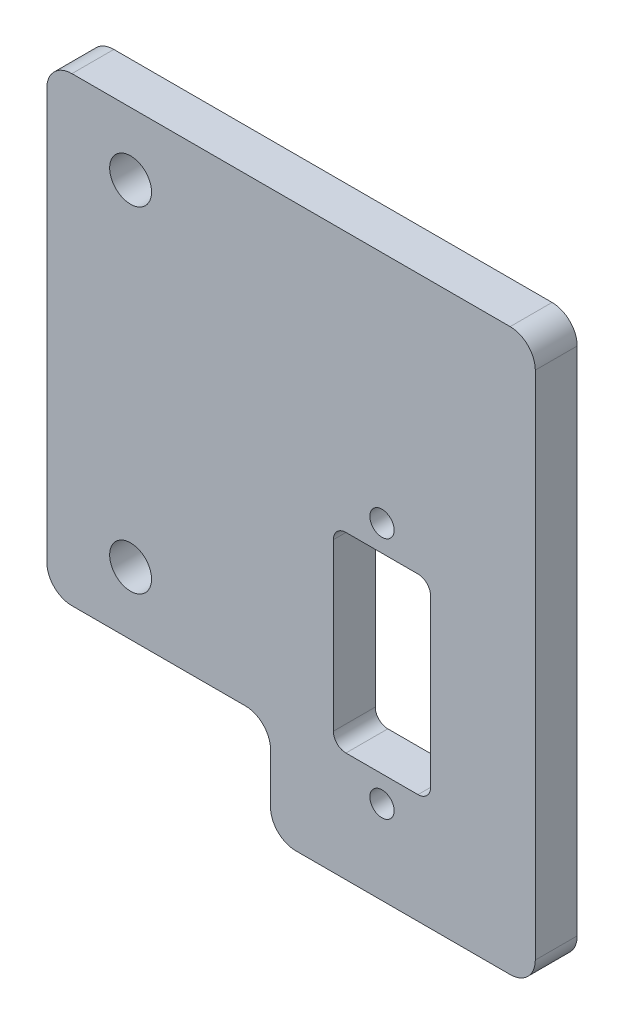
ISO-10303-21;
HEADER;
FILE_DESCRIPTION(('STEP AP214'),'2;1');
FILE_NAME('part.step','',(''),(''),'','','');
FILE_SCHEMA(('AUTOMOTIVE_DESIGN { 1 0 10303 214 1 1 1 1 }'));
ENDSEC;
DATA;
#1=APPLICATION_CONTEXT('core data for automotive mechanical design processes');
#2=APPLICATION_PROTOCOL_DEFINITION('international standard','automotive_design',2000,#1);
#3=PRODUCT_CONTEXT('',#1,'mechanical');
#4=PRODUCT('Part','Part','',(#3));
#5=PRODUCT_RELATED_PRODUCT_CATEGORY('part','',(#4));
#6=PRODUCT_DEFINITION_FORMATION('','',#4);
#7=PRODUCT_DEFINITION_CONTEXT('part definition',#1,'design');
#8=PRODUCT_DEFINITION('design','',#6,#7);
#9=PRODUCT_DEFINITION_SHAPE('','',#8);
#10=(LENGTH_UNIT() NAMED_UNIT(*) SI_UNIT(.MILLI.,.METRE.));
#11=(NAMED_UNIT(*) PLANE_ANGLE_UNIT() SI_UNIT($,.RADIAN.));
#12=(NAMED_UNIT(*) SI_UNIT($,.STERADIAN.) SOLID_ANGLE_UNIT());
#13=UNCERTAINTY_MEASURE_WITH_UNIT(LENGTH_MEASURE(1.E-05),#10,'distance_accuracy_value','');
#14=(GEOMETRIC_REPRESENTATION_CONTEXT(3) GLOBAL_UNCERTAINTY_ASSIGNED_CONTEXT((#13)) GLOBAL_UNIT_ASSIGNED_CONTEXT((#10,
#11,#12)) REPRESENTATION_CONTEXT('',''));
#15=CARTESIAN_POINT('',(0.,0.,0.));
#16=DIRECTION('',(0.,0.,1.));
#17=DIRECTION('',(1.,0.,0.));
#18=AXIS2_PLACEMENT_3D('',#15,#16,#17);
#19=CARTESIAN_POINT('',(0.,0.,5.));
#20=DIRECTION('',(0.,0.,-1.));
#21=DIRECTION('',(-1.,0.,0.));
#22=AXIS2_PLACEMENT_3D('',#19,#20,#21);
#23=PLANE('',#22);
#24=CARTESIAN_POINT('',(13.3,-0.469999999999991,5.));
#25=DIRECTION('',(0.,0.,1.));
#26=DIRECTION('',(1.,0.,0.));
#27=AXIS2_PLACEMENT_3D('',#24,#25,#26);
#28=CIRCLE('',#27,1.45);
#29=CARTESIAN_POINT('',(14.75,-0.469999999999991,5.));
#30=VERTEX_POINT('',#29);
#31=EDGE_CURVE('E408',#30,#30,#28,.T.);
#32=ORIENTED_EDGE('',*,*,#31,.F.);
#33=EDGE_LOOP('',(#32));
#34=FACE_BOUND('',#33,.T.);
#35=CARTESIAN_POINT('',(13.3,-29.47,5.));
#36=DIRECTION('',(0.,0.,1.));
#37=DIRECTION('',(1.,0.,0.));
#38=AXIS2_PLACEMENT_3D('',#35,#36,#37);
#39=CIRCLE('',#38,1.45);
#40=CARTESIAN_POINT('',(14.75,-29.47,5.));
#41=VERTEX_POINT('',#40);
#42=EDGE_CURVE('E410',#41,#41,#39,.T.);
#43=ORIENTED_EDGE('',*,*,#42,.F.);
#44=EDGE_LOOP('',(#43));
#45=FACE_BOUND('',#44,.T.);
#46=CARTESIAN_POINT('',(-16.7,-20.,5.));
#47=DIRECTION('',(0.,0.,-1.));
#48=DIRECTION('',(-1.,0.,0.));
#49=AXIS2_PLACEMENT_3D('',#46,#47,#48);
#50=CIRCLE('',#49,2.5);
#51=CARTESIAN_POINT('',(-19.2,-20.,5.));
#52=VERTEX_POINT('',#51);
#53=EDGE_CURVE('E421',#52,#52,#50,.T.);
#54=ORIENTED_EDGE('',*,*,#53,.T.);
#55=EDGE_LOOP('',(#54));
#56=FACE_BOUND('',#55,.T.);
#57=CARTESIAN_POINT('',(-16.7,20.,5.));
#58=DIRECTION('',(0.,0.,-1.));
#59=DIRECTION('',(-1.,0.,0.));
#60=AXIS2_PLACEMENT_3D('',#57,#58,#59);
#61=CIRCLE('',#60,2.5);
#62=CARTESIAN_POINT('',(-19.2,20.,5.));
#63=VERTEX_POINT('',#62);
#64=EDGE_CURVE('E312',#63,#63,#61,.T.);
#65=ORIENTED_EDGE('',*,*,#64,.T.);
#66=EDGE_LOOP('',(#65));
#67=FACE_BOUND('',#66,.T.);
#68=DIRECTION('',(0.,1.,0.));
#69=VECTOR('',#68,1.);
#70=CARTESIAN_POINT('',(31.6,27.5,5.));
#71=LINE('',#70,#69);
#72=CARTESIAN_POINT('',(31.6,-36.47,5.));
#73=VERTEX_POINT('',#72);
#74=CARTESIAN_POINT('',(31.6,24.5,5.));
#75=VERTEX_POINT('',#74);
#76=EDGE_CURVE('E205',#73,#75,#71,.T.);
#77=ORIENTED_EDGE('',*,*,#76,.T.);
#78=CARTESIAN_POINT('',(28.6,24.5,5.));
#79=DIRECTION('',(0.,0.,-1.));
#80=DIRECTION('',(-1.,0.,0.));
#81=AXIS2_PLACEMENT_3D('',#78,#79,#80);
#82=CIRCLE('',#81,3.);
#83=CARTESIAN_POINT('',(28.6,27.5,5.));
#84=VERTEX_POINT('',#83);
#85=EDGE_CURVE('E224',#75,#84,#82,.F.);
#86=ORIENTED_EDGE('',*,*,#85,.T.);
#87=DIRECTION('',(-1.,0.,0.));
#88=VECTOR('',#87,1.);
#89=CARTESIAN_POINT('',(0.,27.5,5.));
#90=LINE('',#89,#88);
#91=CARTESIAN_POINT('',(-23.7,27.5,5.));
#92=VERTEX_POINT('',#91);
#93=EDGE_CURVE('E190',#84,#92,#90,.T.);
#94=ORIENTED_EDGE('',*,*,#93,.T.);
#95=CARTESIAN_POINT('',(-23.7,24.5,5.));
#96=DIRECTION('',(0.,0.,-1.));
#97=DIRECTION('',(-1.,0.,0.));
#98=AXIS2_PLACEMENT_3D('',#95,#96,#97);
#99=CIRCLE('',#98,3.);
#100=CARTESIAN_POINT('',(-26.7,24.5,5.));
#101=VERTEX_POINT('',#100);
#102=EDGE_CURVE('E216',#92,#101,#99,.F.);
#103=ORIENTED_EDGE('',*,*,#102,.T.);
#104=DIRECTION('',(0.,-1.,0.));
#105=VECTOR('',#104,1.);
#106=CARTESIAN_POINT('',(-26.7,27.5,5.));
#107=LINE('',#106,#105);
#108=CARTESIAN_POINT('',(-26.7,-24.5,5.));
#109=VERTEX_POINT('',#108);
#110=EDGE_CURVE('E199',#101,#109,#107,.T.);
#111=ORIENTED_EDGE('',*,*,#110,.T.);
#112=CARTESIAN_POINT('',(-23.7,-24.5,5.));
#113=DIRECTION('',(0.,0.,-1.));
#114=DIRECTION('',(-1.,0.,0.));
#115=AXIS2_PLACEMENT_3D('',#112,#113,#114);
#116=CIRCLE('',#115,3.);
#117=CARTESIAN_POINT('',(-23.7,-27.5,5.));
#118=VERTEX_POINT('',#117);
#119=EDGE_CURVE('E218',#109,#118,#116,.F.);
#120=ORIENTED_EDGE('',*,*,#119,.T.);
#121=DIRECTION('',(1.,0.,0.));
#122=VECTOR('',#121,1.);
#123=CARTESIAN_POINT('',(-26.7,-27.5,5.));
#124=LINE('',#123,#122);
#125=CARTESIAN_POINT('',(-3.,-27.5,5.));
#126=VERTEX_POINT('',#125);
#127=EDGE_CURVE('E318',#118,#126,#124,.T.);
#128=ORIENTED_EDGE('',*,*,#127,.T.);
#129=CARTESIAN_POINT('',(-3.,-30.5,5.));
#130=DIRECTION('',(0.,0.,-1.));
#131=DIRECTION('',(-1.,0.,0.));
#132=AXIS2_PLACEMENT_3D('',#129,#130,#131);
#133=CIRCLE('',#132,3.);
#134=CARTESIAN_POINT('',(0.,-30.5,5.));
#135=VERTEX_POINT('',#134);
#136=EDGE_CURVE('E248',#126,#135,#133,.T.);
#137=ORIENTED_EDGE('',*,*,#136,.T.);
#138=DIRECTION('',(0.,-1.,0.));
#139=VECTOR('',#138,1.);
#140=CARTESIAN_POINT('',(0.,-27.5,5.));
#141=LINE('',#140,#139);
#142=CARTESIAN_POINT('',(0.,-36.47,5.));
#143=VERTEX_POINT('',#142);
#144=EDGE_CURVE('E321',#135,#143,#141,.T.);
#145=ORIENTED_EDGE('',*,*,#144,.T.);
#146=CARTESIAN_POINT('',(3.,-36.47,5.));
#147=DIRECTION('',(0.,0.,-1.));
#148=DIRECTION('',(-1.,0.,0.));
#149=AXIS2_PLACEMENT_3D('',#146,#147,#148);
#150=CIRCLE('',#149,3.);
#151=CARTESIAN_POINT('',(3.,-39.47,5.));
#152=VERTEX_POINT('',#151);
#153=EDGE_CURVE('E220',#143,#152,#150,.F.);
#154=ORIENTED_EDGE('',*,*,#153,.T.);
#155=DIRECTION('',(1.,0.,0.));
#156=VECTOR('',#155,1.);
#157=CARTESIAN_POINT('',(0.,-39.47,5.));
#158=LINE('',#157,#156);
#159=CARTESIAN_POINT('',(28.6,-39.47,5.));
#160=VERTEX_POINT('',#159);
#161=EDGE_CURVE('E324',#152,#160,#158,.T.);
#162=ORIENTED_EDGE('',*,*,#161,.T.);
#163=CARTESIAN_POINT('',(28.6,-36.47,5.));
#164=DIRECTION('',(0.,0.,-1.));
#165=DIRECTION('',(-1.,0.,0.));
#166=AXIS2_PLACEMENT_3D('',#163,#164,#165);
#167=CIRCLE('',#166,3.);
#168=EDGE_CURVE('E222',#160,#73,#167,.F.);
#169=ORIENTED_EDGE('',*,*,#168,.T.);
#170=EDGE_LOOP('',(#77,#86,#94,#103,#111,#120,#128,#137,#145,#154,#162,#169));
#171=FACE_BOUND('',#170,.T.);
#172=DIRECTION('',(0.,1.,0.));
#173=VECTOR('',#172,1.);
#174=CARTESIAN_POINT('',(19.1,-3.56999999999999,5.));
#175=LINE('',#174,#173);
#176=CARTESIAN_POINT('',(19.1,-24.87,5.));
#177=VERTEX_POINT('',#176);
#178=CARTESIAN_POINT('',(19.1,-5.06999999999999,5.));
#179=VERTEX_POINT('',#178);
#180=EDGE_CURVE('E298',#177,#179,#175,.T.);
#181=ORIENTED_EDGE('',*,*,#180,.F.);
#182=CARTESIAN_POINT('',(17.6,-24.87,5.));
#183=DIRECTION('',(0.,0.,-1.));
#184=DIRECTION('',(-1.,0.,0.));
#185=AXIS2_PLACEMENT_3D('',#182,#183,#184);
#186=CIRCLE('',#185,1.5);
#187=CARTESIAN_POINT('',(17.6,-26.37,5.));
#188=VERTEX_POINT('',#187);
#189=EDGE_CURVE('E271',#177,#188,#186,.T.);
#190=ORIENTED_EDGE('',*,*,#189,.T.);
#191=DIRECTION('',(1.,0.,0.));
#192=VECTOR('',#191,1.);
#193=CARTESIAN_POINT('',(19.1,-26.37,5.));
#194=LINE('',#193,#192);
#195=CARTESIAN_POINT('',(9.,-26.37,5.));
#196=VERTEX_POINT('',#195);
#197=EDGE_CURVE('E300',#196,#188,#194,.T.);
#198=ORIENTED_EDGE('',*,*,#197,.F.);
#199=CARTESIAN_POINT('',(9.,-24.87,5.));
#200=DIRECTION('',(0.,0.,-1.));
#201=DIRECTION('',(-1.,0.,0.));
#202=AXIS2_PLACEMENT_3D('',#199,#200,#201);
#203=CIRCLE('',#202,1.5);
#204=CARTESIAN_POINT('',(7.5,-24.87,5.));
#205=VERTEX_POINT('',#204);
#206=EDGE_CURVE('E275',#196,#205,#203,.T.);
#207=ORIENTED_EDGE('',*,*,#206,.T.);
#208=DIRECTION('',(0.,-1.,0.));
#209=VECTOR('',#208,1.);
#210=CARTESIAN_POINT('',(7.5,-3.56999999999999,5.));
#211=LINE('',#210,#209);
#212=CARTESIAN_POINT('',(7.5,-5.06999999999999,5.));
#213=VERTEX_POINT('',#212);
#214=EDGE_CURVE('E297',#213,#205,#211,.T.);
#215=ORIENTED_EDGE('',*,*,#214,.F.);
#216=CARTESIAN_POINT('',(9.,-5.06999999999999,5.));
#217=DIRECTION('',(0.,0.,-1.));
#218=DIRECTION('',(-1.,0.,0.));
#219=AXIS2_PLACEMENT_3D('',#216,#217,#218);
#220=CIRCLE('',#219,1.5);
#221=CARTESIAN_POINT('',(9.,-3.56999999999999,5.));
#222=VERTEX_POINT('',#221);
#223=EDGE_CURVE('E11',#213,#222,#220,.T.);
#224=ORIENTED_EDGE('',*,*,#223,.T.);
#225=DIRECTION('',(-1.,0.,0.));
#226=VECTOR('',#225,1.);
#227=CARTESIAN_POINT('',(19.1,-3.56999999999999,5.));
#228=LINE('',#227,#226);
#229=CARTESIAN_POINT('',(17.6,-3.56999999999999,5.));
#230=VERTEX_POINT('',#229);
#231=EDGE_CURVE('E295',#230,#222,#228,.T.);
#232=ORIENTED_EDGE('',*,*,#231,.F.);
#233=CARTESIAN_POINT('',(17.6,-5.06999999999999,5.));
#234=DIRECTION('',(0.,0.,-1.));
#235=DIRECTION('',(-1.,0.,0.));
#236=AXIS2_PLACEMENT_3D('',#233,#234,#235);
#237=CIRCLE('',#236,1.5);
#238=EDGE_CURVE('E279',#230,#179,#237,.T.);
#239=ORIENTED_EDGE('',*,*,#238,.T.);
#240=EDGE_LOOP('',(#181,#190,#198,#207,#215,#224,#232,#239));
#241=FACE_BOUND('',#240,.T.);
#242=ADVANCED_FACE('F33',(#34,#45,#56,#67,#171,#241),#23,.F.);
#243=CARTESIAN_POINT('',(0.,0.,0.));
#244=DIRECTION('',(0.,0.,-1.));
#245=DIRECTION('',(-1.,0.,0.));
#246=AXIS2_PLACEMENT_3D('',#243,#244,#245);
#247=PLANE('',#246);
#248=CARTESIAN_POINT('',(13.3,-0.469999999999991,0.));
#249=DIRECTION('',(0.,0.,1.));
#250=DIRECTION('',(1.,0.,0.));
#251=AXIS2_PLACEMENT_3D('',#248,#249,#250);
#252=CIRCLE('',#251,1.45);
#253=CARTESIAN_POINT('',(14.75,-0.469999999999991,0.));
#254=VERTEX_POINT('',#253);
#255=EDGE_CURVE('E406',#254,#254,#252,.T.);
#256=ORIENTED_EDGE('',*,*,#255,.T.);
#257=EDGE_LOOP('',(#256));
#258=FACE_BOUND('',#257,.T.);
#259=CARTESIAN_POINT('',(13.3,-29.47,0.));
#260=DIRECTION('',(0.,0.,1.));
#261=DIRECTION('',(1.,0.,0.));
#262=AXIS2_PLACEMENT_3D('',#259,#260,#261);
#263=CIRCLE('',#262,1.45);
#264=CARTESIAN_POINT('',(14.75,-29.47,0.));
#265=VERTEX_POINT('',#264);
#266=EDGE_CURVE('E415',#265,#265,#263,.T.);
#267=ORIENTED_EDGE('',*,*,#266,.T.);
#268=EDGE_LOOP('',(#267));
#269=FACE_BOUND('',#268,.T.);
#270=CARTESIAN_POINT('',(-16.7,-20.,0.));
#271=DIRECTION('',(0.,0.,-1.));
#272=DIRECTION('',(-1.,0.,0.));
#273=AXIS2_PLACEMENT_3D('',#270,#271,#272);
#274=CIRCLE('',#273,2.5);
#275=CARTESIAN_POINT('',(-19.2,-20.,0.));
#276=VERTEX_POINT('',#275);
#277=EDGE_CURVE('E418',#276,#276,#274,.T.);
#278=ORIENTED_EDGE('',*,*,#277,.F.);
#279=EDGE_LOOP('',(#278));
#280=FACE_BOUND('',#279,.T.);
#281=CARTESIAN_POINT('',(-16.7,20.,0.));
#282=DIRECTION('',(0.,0.,-1.));
#283=DIRECTION('',(-1.,0.,0.));
#284=AXIS2_PLACEMENT_3D('',#281,#282,#283);
#285=CIRCLE('',#284,2.5);
#286=CARTESIAN_POINT('',(-19.2,20.,0.));
#287=VERTEX_POINT('',#286);
#288=EDGE_CURVE('E424',#287,#287,#285,.T.);
#289=ORIENTED_EDGE('',*,*,#288,.F.);
#290=EDGE_LOOP('',(#289));
#291=FACE_BOUND('',#290,.T.);
#292=DIRECTION('',(-1.,0.,0.));
#293=VECTOR('',#292,1.);
#294=CARTESIAN_POINT('',(26.6,27.5,0.));
#295=LINE('',#294,#293);
#296=CARTESIAN_POINT('',(28.6,27.5,0.));
#297=VERTEX_POINT('',#296);
#298=CARTESIAN_POINT('',(-23.7,27.5,0.));
#299=VERTEX_POINT('',#298);
#300=EDGE_CURVE('E187',#297,#299,#295,.T.);
#301=ORIENTED_EDGE('',*,*,#300,.F.);
#302=CARTESIAN_POINT('',(28.6,24.5,0.));
#303=DIRECTION('',(0.,0.,-1.));
#304=DIRECTION('',(-1.,0.,0.));
#305=AXIS2_PLACEMENT_3D('',#302,#303,#304);
#306=CIRCLE('',#305,3.);
#307=CARTESIAN_POINT('',(31.6,24.5,0.));
#308=VERTEX_POINT('',#307);
#309=EDGE_CURVE('E170',#297,#308,#306,.T.);
#310=ORIENTED_EDGE('',*,*,#309,.T.);
#311=DIRECTION('',(0.,1.,0.));
#312=VECTOR('',#311,1.);
#313=CARTESIAN_POINT('',(31.6,27.5,0.));
#314=LINE('',#313,#312);
#315=CARTESIAN_POINT('',(31.6,-36.47,0.));
#316=VERTEX_POINT('',#315);
#317=EDGE_CURVE('E197',#316,#308,#314,.T.);
#318=ORIENTED_EDGE('',*,*,#317,.F.);
#319=CARTESIAN_POINT('',(28.6,-36.47,0.));
#320=DIRECTION('',(0.,0.,-1.));
#321=DIRECTION('',(-1.,0.,0.));
#322=AXIS2_PLACEMENT_3D('',#319,#320,#321);
#323=CIRCLE('',#322,3.);
#324=CARTESIAN_POINT('',(28.6,-39.47,0.));
#325=VERTEX_POINT('',#324);
#326=EDGE_CURVE('E181',#316,#325,#323,.T.);
#327=ORIENTED_EDGE('',*,*,#326,.T.);
#328=DIRECTION('',(1.,0.,0.));
#329=VECTOR('',#328,1.);
#330=CARTESIAN_POINT('',(31.6,-39.47,0.));
#331=LINE('',#330,#329);
#332=CARTESIAN_POINT('',(3.,-39.47,0.));
#333=VERTEX_POINT('',#332);
#334=EDGE_CURVE('E201',#333,#325,#331,.T.);
#335=ORIENTED_EDGE('',*,*,#334,.F.);
#336=CARTESIAN_POINT('',(3.,-36.47,0.));
#337=DIRECTION('',(0.,0.,-1.));
#338=DIRECTION('',(-1.,0.,0.));
#339=AXIS2_PLACEMENT_3D('',#336,#337,#338);
#340=CIRCLE('',#339,3.);
#341=CARTESIAN_POINT('',(0.,-36.47,0.));
#342=VERTEX_POINT('',#341);
#343=EDGE_CURVE('E210',#333,#342,#340,.T.);
#344=ORIENTED_EDGE('',*,*,#343,.T.);
#345=DIRECTION('',(0.,-1.,0.));
#346=VECTOR('',#345,1.);
#347=CARTESIAN_POINT('',(0.,-27.5,0.));
#348=LINE('',#347,#346);
#349=CARTESIAN_POINT('',(0.,-30.5,0.));
#350=VERTEX_POINT('',#349);
#351=EDGE_CURVE('E334',#350,#342,#348,.T.);
#352=ORIENTED_EDGE('',*,*,#351,.F.);
#353=CARTESIAN_POINT('',(-3.,-30.5,0.));
#354=DIRECTION('',(0.,0.,-1.));
#355=DIRECTION('',(-1.,0.,0.));
#356=AXIS2_PLACEMENT_3D('',#353,#354,#355);
#357=CIRCLE('',#356,3.);
#358=CARTESIAN_POINT('',(-3.,-27.5,0.));
#359=VERTEX_POINT('',#358);
#360=EDGE_CURVE('E246',#350,#359,#357,.F.);
#361=ORIENTED_EDGE('',*,*,#360,.T.);
#362=DIRECTION('',(1.,0.,0.));
#363=VECTOR('',#362,1.);
#364=CARTESIAN_POINT('',(-26.7,-27.5,0.));
#365=LINE('',#364,#363);
#366=CARTESIAN_POINT('',(-23.7,-27.5,0.));
#367=VERTEX_POINT('',#366);
#368=EDGE_CURVE('E331',#367,#359,#365,.T.);
#369=ORIENTED_EDGE('',*,*,#368,.F.);
#370=CARTESIAN_POINT('',(-23.7,-24.5,0.));
#371=DIRECTION('',(0.,0.,-1.));
#372=DIRECTION('',(-1.,0.,0.));
#373=AXIS2_PLACEMENT_3D('',#370,#371,#372);
#374=CIRCLE('',#373,3.);
#375=CARTESIAN_POINT('',(-26.7,-24.5,0.));
#376=VERTEX_POINT('',#375);
#377=EDGE_CURVE('E208',#367,#376,#374,.T.);
#378=ORIENTED_EDGE('',*,*,#377,.T.);
#379=DIRECTION('',(0.,-1.,0.));
#380=VECTOR('',#379,1.);
#381=CARTESIAN_POINT('',(-26.7,27.5,0.));
#382=LINE('',#381,#380);
#383=CARTESIAN_POINT('',(-26.7,24.5,0.));
#384=VERTEX_POINT('',#383);
#385=EDGE_CURVE('E308',#384,#376,#382,.T.);
#386=ORIENTED_EDGE('',*,*,#385,.F.);
#387=CARTESIAN_POINT('',(-23.7,24.5,0.));
#388=DIRECTION('',(0.,0.,-1.));
#389=DIRECTION('',(-1.,0.,0.));
#390=AXIS2_PLACEMENT_3D('',#387,#388,#389);
#391=CIRCLE('',#390,3.);
#392=EDGE_CURVE('E191',#384,#299,#391,.T.);
#393=ORIENTED_EDGE('',*,*,#392,.T.);
#394=EDGE_LOOP('',(#301,#310,#318,#327,#335,#344,#352,#361,#369,#378,#386,#393));
#395=FACE_BOUND('',#394,.T.);
#396=DIRECTION('',(0.,-1.,0.));
#397=VECTOR('',#396,1.);
#398=CARTESIAN_POINT('',(7.5,-3.56999999999999,0.));
#399=LINE('',#398,#397);
#400=CARTESIAN_POINT('',(7.5,-5.06999999999999,0.));
#401=VERTEX_POINT('',#400);
#402=CARTESIAN_POINT('',(7.5,-24.87,0.));
#403=VERTEX_POINT('',#402);
#404=EDGE_CURVE('E283',#401,#403,#399,.T.);
#405=ORIENTED_EDGE('',*,*,#404,.T.);
#406=CARTESIAN_POINT('',(9.,-24.87,0.));
#407=DIRECTION('',(0.,0.,-1.));
#408=DIRECTION('',(-1.,0.,0.));
#409=AXIS2_PLACEMENT_3D('',#406,#407,#408);
#410=CIRCLE('',#409,1.5);
#411=CARTESIAN_POINT('',(9.,-26.37,0.));
#412=VERTEX_POINT('',#411);
#413=EDGE_CURVE('E273',#403,#412,#410,.F.);
#414=ORIENTED_EDGE('',*,*,#413,.T.);
#415=DIRECTION('',(1.,0.,0.));
#416=VECTOR('',#415,1.);
#417=CARTESIAN_POINT('',(19.1,-26.37,0.));
#418=LINE('',#417,#416);
#419=CARTESIAN_POINT('',(17.6,-26.37,0.));
#420=VERTEX_POINT('',#419);
#421=EDGE_CURVE('E292',#412,#420,#418,.T.);
#422=ORIENTED_EDGE('',*,*,#421,.T.);
#423=CARTESIAN_POINT('',(17.6,-24.87,0.));
#424=DIRECTION('',(0.,0.,-1.));
#425=DIRECTION('',(-1.,0.,0.));
#426=AXIS2_PLACEMENT_3D('',#423,#424,#425);
#427=CIRCLE('',#426,1.5);
#428=CARTESIAN_POINT('',(19.1,-24.87,0.));
#429=VERTEX_POINT('',#428);
#430=EDGE_CURVE('E269',#420,#429,#427,.F.);
#431=ORIENTED_EDGE('',*,*,#430,.T.);
#432=DIRECTION('',(0.,1.,0.));
#433=VECTOR('',#432,1.);
#434=CARTESIAN_POINT('',(19.1,-3.56999999999999,0.));
#435=LINE('',#434,#433);
#436=CARTESIAN_POINT('',(19.1,-5.06999999999999,0.));
#437=VERTEX_POINT('',#436);
#438=EDGE_CURVE('E309',#429,#437,#435,.T.);
#439=ORIENTED_EDGE('',*,*,#438,.T.);
#440=CARTESIAN_POINT('',(17.6,-5.06999999999999,0.));
#441=DIRECTION('',(0.,0.,-1.));
#442=DIRECTION('',(-1.,0.,0.));
#443=AXIS2_PLACEMENT_3D('',#440,#441,#442);
#444=CIRCLE('',#443,1.5);
#445=CARTESIAN_POINT('',(17.6,-3.56999999999999,0.));
#446=VERTEX_POINT('',#445);
#447=EDGE_CURVE('E277',#437,#446,#444,.F.);
#448=ORIENTED_EDGE('',*,*,#447,.T.);
#449=DIRECTION('',(-1.,0.,0.));
#450=VECTOR('',#449,1.);
#451=CARTESIAN_POINT('',(19.1,-3.56999999999999,0.));
#452=LINE('',#451,#450);
#453=CARTESIAN_POINT('',(9.,-3.56999999999999,0.));
#454=VERTEX_POINT('',#453);
#455=EDGE_CURVE('E284',#446,#454,#452,.T.);
#456=ORIENTED_EDGE('',*,*,#455,.T.);
#457=CARTESIAN_POINT('',(9.,-5.06999999999999,0.));
#458=DIRECTION('',(0.,0.,-1.));
#459=DIRECTION('',(-1.,0.,0.));
#460=AXIS2_PLACEMENT_3D('',#457,#458,#459);
#461=CIRCLE('',#460,1.5);
#462=EDGE_CURVE('E41',#454,#401,#461,.F.);
#463=ORIENTED_EDGE('',*,*,#462,.T.);
#464=EDGE_LOOP('',(#405,#414,#422,#431,#439,#448,#456,#463));
#465=FACE_BOUND('',#464,.T.);
#466=ADVANCED_FACE('F194',(#258,#269,#280,#291,#395,#465),#247,.T.);
#467=CARTESIAN_POINT('',(-26.7,27.5,5.));
#468=DIRECTION('',(1.,0.,0.));
#469=DIRECTION('',(0.,0.,-1.));
#470=AXIS2_PLACEMENT_3D('',#467,#468,#469);
#471=PLANE('',#470);
#472=ORIENTED_EDGE('',*,*,#385,.T.);
#473=DIRECTION('',(0.,0.,-1.));
#474=VECTOR('',#473,1.);
#475=CARTESIAN_POINT('',(-26.7,-24.5,5.));
#476=LINE('',#475,#474);
#477=EDGE_CURVE('E244',#376,#109,#476,.F.);
#478=ORIENTED_EDGE('',*,*,#477,.T.);
#479=ORIENTED_EDGE('',*,*,#110,.F.);
#480=DIRECTION('',(0.,0.,-1.));
#481=VECTOR('',#480,1.);
#482=CARTESIAN_POINT('',(-26.7,24.5,5.));
#483=LINE('',#482,#481);
#484=EDGE_CURVE('E241',#101,#384,#483,.T.);
#485=ORIENTED_EDGE('',*,*,#484,.T.);
#486=EDGE_LOOP('',(#472,#478,#479,#485));
#487=FACE_BOUND('',#486,.T.);
#488=ADVANCED_FACE('F367',(#487),#471,.F.);
#489=CARTESIAN_POINT('',(-26.7,-27.5,5.));
#490=DIRECTION('',(0.,1.,0.));
#491=DIRECTION('',(-1.,0.,0.));
#492=AXIS2_PLACEMENT_3D('',#489,#490,#491);
#493=PLANE('',#492);
#494=ORIENTED_EDGE('',*,*,#368,.T.);
#495=DIRECTION('',(0.,0.,-1.));
#496=VECTOR('',#495,1.);
#497=CARTESIAN_POINT('',(-3.,-27.5,5.));
#498=LINE('',#497,#496);
#499=EDGE_CURVE('E239',#359,#126,#498,.F.);
#500=ORIENTED_EDGE('',*,*,#499,.T.);
#501=ORIENTED_EDGE('',*,*,#127,.F.);
#502=DIRECTION('',(0.,0.,-1.));
#503=VECTOR('',#502,1.);
#504=CARTESIAN_POINT('',(-23.7,-27.5,5.));
#505=LINE('',#504,#503);
#506=EDGE_CURVE('E236',#118,#367,#505,.T.);
#507=ORIENTED_EDGE('',*,*,#506,.T.);
#508=EDGE_LOOP('',(#494,#500,#501,#507));
#509=FACE_BOUND('',#508,.T.);
#510=ADVANCED_FACE('F605',(#509),#493,.F.);
#511=CARTESIAN_POINT('',(0.,-27.5,5.));
#512=DIRECTION('',(1.,0.,0.));
#513=DIRECTION('',(0.,1.,0.));
#514=AXIS2_PLACEMENT_3D('',#511,#512,#513);
#515=PLANE('',#514);
#516=ORIENTED_EDGE('',*,*,#351,.T.);
#517=DIRECTION('',(0.,0.,-1.));
#518=VECTOR('',#517,1.);
#519=CARTESIAN_POINT('',(0.,-36.47,5.));
#520=LINE('',#519,#518);
#521=EDGE_CURVE('E234',#342,#143,#520,.F.);
#522=ORIENTED_EDGE('',*,*,#521,.T.);
#523=ORIENTED_EDGE('',*,*,#144,.F.);
#524=DIRECTION('',(0.,0.,-1.));
#525=VECTOR('',#524,1.);
#526=CARTESIAN_POINT('',(0.,-30.5,0.));
#527=LINE('',#526,#525);
#528=EDGE_CURVE('E231',#135,#350,#527,.T.);
#529=ORIENTED_EDGE('',*,*,#528,.T.);
#530=EDGE_LOOP('',(#516,#522,#523,#529));
#531=FACE_BOUND('',#530,.T.);
#532=ADVANCED_FACE('F359',(#531),#515,.F.);
#533=CARTESIAN_POINT('',(31.6,-39.47,5.));
#534=DIRECTION('',(0.,1.,0.));
#535=DIRECTION('',(0.,0.,1.));
#536=AXIS2_PLACEMENT_3D('',#533,#534,#535);
#537=PLANE('',#536);
#538=ORIENTED_EDGE('',*,*,#334,.T.);
#539=DIRECTION('',(0.,0.,-1.));
#540=VECTOR('',#539,1.);
#541=CARTESIAN_POINT('',(28.6,-39.47,5.));
#542=LINE('',#541,#540);
#543=EDGE_CURVE('E229',#325,#160,#542,.F.);
#544=ORIENTED_EDGE('',*,*,#543,.T.);
#545=ORIENTED_EDGE('',*,*,#161,.F.);
#546=DIRECTION('',(0.,0.,-1.));
#547=VECTOR('',#546,1.);
#548=CARTESIAN_POINT('',(3.,-39.47,5.));
#549=LINE('',#548,#547);
#550=EDGE_CURVE('E226',#152,#333,#549,.T.);
#551=ORIENTED_EDGE('',*,*,#550,.T.);
#552=EDGE_LOOP('',(#538,#544,#545,#551));
#553=FACE_BOUND('',#552,.T.);
#554=ADVANCED_FACE('F340',(#553),#537,.F.);
#555=CARTESIAN_POINT('',(31.6,27.5,5.));
#556=DIRECTION('',(-1.,0.,0.));
#557=DIRECTION('',(0.,-1.,0.));
#558=AXIS2_PLACEMENT_3D('',#555,#556,#557);
#559=PLANE('',#558);
#560=ORIENTED_EDGE('',*,*,#317,.T.);
#561=DIRECTION('',(0.,0.,-1.));
#562=VECTOR('',#561,1.);
#563=CARTESIAN_POINT('',(31.6,24.5,5.));
#564=LINE('',#563,#562);
#565=EDGE_CURVE('E175',#308,#75,#564,.F.);
#566=ORIENTED_EDGE('',*,*,#565,.T.);
#567=ORIENTED_EDGE('',*,*,#76,.F.);
#568=DIRECTION('',(0.,0.,-1.));
#569=VECTOR('',#568,1.);
#570=CARTESIAN_POINT('',(31.6,-36.47,5.));
#571=LINE('',#570,#569);
#572=EDGE_CURVE('E180',#73,#316,#571,.T.);
#573=ORIENTED_EDGE('',*,*,#572,.T.);
#574=EDGE_LOOP('',(#560,#566,#567,#573));
#575=FACE_BOUND('',#574,.T.);
#576=ADVANCED_FACE('F350',(#575),#559,.F.);
#577=CARTESIAN_POINT('',(26.6,27.5,5.));
#578=DIRECTION('',(0.,-1.,0.));
#579=DIRECTION('',(0.,0.,-1.));
#580=AXIS2_PLACEMENT_3D('',#577,#578,#579);
#581=PLANE('',#580);
#582=ORIENTED_EDGE('',*,*,#93,.F.);
#583=DIRECTION('',(0.,0.,-1.));
#584=VECTOR('',#583,1.);
#585=CARTESIAN_POINT('',(28.6,27.5,5.));
#586=LINE('',#585,#584);
#587=EDGE_CURVE('E174',#84,#297,#586,.T.);
#588=ORIENTED_EDGE('',*,*,#587,.T.);
#589=ORIENTED_EDGE('',*,*,#300,.T.);
#590=DIRECTION('',(0.,0.,-1.));
#591=VECTOR('',#590,1.);
#592=CARTESIAN_POINT('',(-23.7,27.5,5.));
#593=LINE('',#592,#591);
#594=EDGE_CURVE('E192',#299,#92,#593,.F.);
#595=ORIENTED_EDGE('',*,*,#594,.T.);
#596=EDGE_LOOP('',(#582,#588,#589,#595));
#597=FACE_BOUND('',#596,.T.);
#598=ADVANCED_FACE('F186',(#597),#581,.F.);
#599=CARTESIAN_POINT('',(19.1,-3.56999999999999,5.));
#600=DIRECTION('',(-1.,0.,0.));
#601=DIRECTION('',(0.,0.,1.));
#602=AXIS2_PLACEMENT_3D('',#599,#600,#601);
#603=PLANE('',#602);
#604=ORIENTED_EDGE('',*,*,#438,.F.);
#605=DIRECTION('',(0.,0.,-1.));
#606=VECTOR('',#605,1.);
#607=CARTESIAN_POINT('',(19.1,-24.87,5.));
#608=LINE('',#607,#606);
#609=EDGE_CURVE('E258',#429,#177,#608,.F.);
#610=ORIENTED_EDGE('',*,*,#609,.T.);
#611=ORIENTED_EDGE('',*,*,#180,.T.);
#612=DIRECTION('',(0.,0.,-1.));
#613=VECTOR('',#612,1.);
#614=CARTESIAN_POINT('',(19.1,-5.06999999999999,0.));
#615=LINE('',#614,#613);
#616=EDGE_CURVE('E255',#179,#437,#615,.T.);
#617=ORIENTED_EDGE('',*,*,#616,.T.);
#618=EDGE_LOOP('',(#604,#610,#611,#617));
#619=FACE_BOUND('',#618,.T.);
#620=ADVANCED_FACE('F357',(#619),#603,.T.);
#621=CARTESIAN_POINT('',(19.1,-3.56999999999999,5.));
#622=DIRECTION('',(0.,-1.,0.));
#623=DIRECTION('',(0.,0.,-1.));
#624=AXIS2_PLACEMENT_3D('',#621,#622,#623);
#625=PLANE('',#624);
#626=ORIENTED_EDGE('',*,*,#455,.F.);
#627=DIRECTION('',(0.,0.,-1.));
#628=VECTOR('',#627,1.);
#629=CARTESIAN_POINT('',(17.6,-3.56999999999999,5.));
#630=LINE('',#629,#628);
#631=EDGE_CURVE('E53',#446,#230,#630,.F.);
#632=ORIENTED_EDGE('',*,*,#631,.T.);
#633=ORIENTED_EDGE('',*,*,#231,.T.);
#634=DIRECTION('',(0.,0.,-1.));
#635=VECTOR('',#634,1.);
#636=CARTESIAN_POINT('',(9.,-3.56999999999999,0.));
#637=LINE('',#636,#635);
#638=EDGE_CURVE('E265',#222,#454,#637,.T.);
#639=ORIENTED_EDGE('',*,*,#638,.T.);
#640=EDGE_LOOP('',(#626,#632,#633,#639));
#641=FACE_BOUND('',#640,.T.);
#642=ADVANCED_FACE('F294',(#641),#625,.T.);
#643=CARTESIAN_POINT('',(7.5,-3.56999999999999,5.));
#644=DIRECTION('',(1.,0.,0.));
#645=DIRECTION('',(0.,0.,-1.));
#646=AXIS2_PLACEMENT_3D('',#643,#644,#645);
#647=PLANE('',#646);
#648=ORIENTED_EDGE('',*,*,#214,.T.);
#649=DIRECTION('',(0.,0.,-1.));
#650=VECTOR('',#649,1.);
#651=CARTESIAN_POINT('',(7.5,-24.87,0.));
#652=LINE('',#651,#650);
#653=EDGE_CURVE('E262',#205,#403,#652,.T.);
#654=ORIENTED_EDGE('',*,*,#653,.T.);
#655=ORIENTED_EDGE('',*,*,#404,.F.);
#656=DIRECTION('',(0.,0.,-1.));
#657=VECTOR('',#656,1.);
#658=CARTESIAN_POINT('',(7.5,-5.06999999999999,5.));
#659=LINE('',#658,#657);
#660=EDGE_CURVE('E260',#401,#213,#659,.F.);
#661=ORIENTED_EDGE('',*,*,#660,.T.);
#662=EDGE_LOOP('',(#648,#654,#655,#661));
#663=FACE_BOUND('',#662,.T.);
#664=ADVANCED_FACE('F290',(#663),#647,.T.);
#665=CARTESIAN_POINT('',(19.1,-26.37,5.));
#666=DIRECTION('',(0.,1.,0.));
#667=DIRECTION('',(0.,0.,1.));
#668=AXIS2_PLACEMENT_3D('',#665,#666,#667);
#669=PLANE('',#668);
#670=ORIENTED_EDGE('',*,*,#197,.T.);
#671=DIRECTION('',(0.,0.,-1.));
#672=VECTOR('',#671,1.);
#673=CARTESIAN_POINT('',(17.6,-26.37,0.));
#674=LINE('',#673,#672);
#675=EDGE_CURVE('E252',#188,#420,#674,.T.);
#676=ORIENTED_EDGE('',*,*,#675,.T.);
#677=ORIENTED_EDGE('',*,*,#421,.F.);
#678=DIRECTION('',(0.,0.,-1.));
#679=VECTOR('',#678,1.);
#680=CARTESIAN_POINT('',(9.,-26.37,5.));
#681=LINE('',#680,#679);
#682=EDGE_CURVE('E250',#412,#196,#681,.F.);
#683=ORIENTED_EDGE('',*,*,#682,.T.);
#684=EDGE_LOOP('',(#670,#676,#677,#683));
#685=FACE_BOUND('',#684,.T.);
#686=ADVANCED_FACE('F380',(#685),#669,.T.);
#687=CARTESIAN_POINT('',(-16.7,20.,0.));
#688=DIRECTION('',(0.,0.,-1.));
#689=DIRECTION('',(-1.,0.,0.));
#690=AXIS2_PLACEMENT_3D('',#687,#688,#689);
#691=CYLINDRICAL_SURFACE('',#690,2.5);
#692=ORIENTED_EDGE('',*,*,#64,.F.);
#693=EDGE_LOOP('',(#692));
#694=FACE_BOUND('',#693,.T.);
#695=ORIENTED_EDGE('',*,*,#288,.T.);
#696=EDGE_LOOP('',(#695));
#697=FACE_BOUND('',#696,.T.);
#698=ADVANCED_FACE('F383',(#694,#697),#691,.F.);
#699=CARTESIAN_POINT('',(-16.7,-20.,0.));
#700=DIRECTION('',(0.,0.,-1.));
#701=DIRECTION('',(-1.,0.,0.));
#702=AXIS2_PLACEMENT_3D('',#699,#700,#701);
#703=CYLINDRICAL_SURFACE('',#702,2.5);
#704=ORIENTED_EDGE('',*,*,#53,.F.);
#705=EDGE_LOOP('',(#704));
#706=FACE_BOUND('',#705,.T.);
#707=ORIENTED_EDGE('',*,*,#277,.T.);
#708=EDGE_LOOP('',(#707));
#709=FACE_BOUND('',#708,.T.);
#710=ADVANCED_FACE('F387',(#706,#709),#703,.F.);
#711=CARTESIAN_POINT('',(13.3,-29.47,5.));
#712=DIRECTION('',(0.,0.,1.));
#713=DIRECTION('',(1.,0.,0.));
#714=AXIS2_PLACEMENT_3D('',#711,#712,#713);
#715=CYLINDRICAL_SURFACE('',#714,1.45);
#716=ORIENTED_EDGE('',*,*,#266,.F.);
#717=EDGE_LOOP('',(#716));
#718=FACE_BOUND('',#717,.T.);
#719=ORIENTED_EDGE('',*,*,#42,.T.);
#720=EDGE_LOOP('',(#719));
#721=FACE_BOUND('',#720,.T.);
#722=ADVANCED_FACE('F391',(#718,#721),#715,.F.);
#723=CARTESIAN_POINT('',(13.3,-0.469999999999991,5.));
#724=DIRECTION('',(0.,0.,1.));
#725=DIRECTION('',(1.,0.,0.));
#726=AXIS2_PLACEMENT_3D('',#723,#724,#725);
#727=CYLINDRICAL_SURFACE('',#726,1.45);
#728=ORIENTED_EDGE('',*,*,#255,.F.);
#729=EDGE_LOOP('',(#728));
#730=FACE_BOUND('',#729,.T.);
#731=ORIENTED_EDGE('',*,*,#31,.T.);
#732=EDGE_LOOP('',(#731));
#733=FACE_BOUND('',#732,.T.);
#734=ADVANCED_FACE('F395',(#730,#733),#727,.F.);
#735=CARTESIAN_POINT('',(28.6,24.5,5.));
#736=DIRECTION('',(0.,0.,-1.));
#737=DIRECTION('',(-1.,0.,0.));
#738=AXIS2_PLACEMENT_3D('',#735,#736,#737);
#739=CYLINDRICAL_SURFACE('',#738,3.);
#740=ORIENTED_EDGE('',*,*,#85,.F.);
#741=ORIENTED_EDGE('',*,*,#565,.F.);
#742=ORIENTED_EDGE('',*,*,#309,.F.);
#743=ORIENTED_EDGE('',*,*,#587,.F.);
#744=EDGE_LOOP('',(#740,#741,#742,#743));
#745=FACE_BOUND('',#744,.T.);
#746=ADVANCED_FACE('F173',(#745),#739,.T.);
#747=CARTESIAN_POINT('',(28.6,-36.47,5.));
#748=DIRECTION('',(0.,0.,-1.));
#749=DIRECTION('',(-1.,0.,0.));
#750=AXIS2_PLACEMENT_3D('',#747,#748,#749);
#751=CYLINDRICAL_SURFACE('',#750,3.);
#752=ORIENTED_EDGE('',*,*,#168,.F.);
#753=ORIENTED_EDGE('',*,*,#543,.F.);
#754=ORIENTED_EDGE('',*,*,#326,.F.);
#755=ORIENTED_EDGE('',*,*,#572,.F.);
#756=EDGE_LOOP('',(#752,#753,#754,#755));
#757=FACE_BOUND('',#756,.T.);
#758=ADVANCED_FACE('F345',(#757),#751,.T.);
#759=CARTESIAN_POINT('',(3.,-36.47,5.));
#760=DIRECTION('',(0.,0.,-1.));
#761=DIRECTION('',(-1.,0.,0.));
#762=AXIS2_PLACEMENT_3D('',#759,#760,#761);
#763=CYLINDRICAL_SURFACE('',#762,3.);
#764=ORIENTED_EDGE('',*,*,#153,.F.);
#765=ORIENTED_EDGE('',*,*,#521,.F.);
#766=ORIENTED_EDGE('',*,*,#343,.F.);
#767=ORIENTED_EDGE('',*,*,#550,.F.);
#768=EDGE_LOOP('',(#764,#765,#766,#767));
#769=FACE_BOUND('',#768,.T.);
#770=ADVANCED_FACE('F444',(#769),#763,.T.);
#771=CARTESIAN_POINT('',(-3.,-30.5,5.));
#772=DIRECTION('',(0.,0.,1.));
#773=DIRECTION('',(1.,0.,0.));
#774=AXIS2_PLACEMENT_3D('',#771,#772,#773);
#775=CYLINDRICAL_SURFACE('',#774,3.);
#776=ORIENTED_EDGE('',*,*,#136,.F.);
#777=ORIENTED_EDGE('',*,*,#499,.F.);
#778=ORIENTED_EDGE('',*,*,#360,.F.);
#779=ORIENTED_EDGE('',*,*,#528,.F.);
#780=EDGE_LOOP('',(#776,#777,#778,#779));
#781=FACE_BOUND('',#780,.T.);
#782=ADVANCED_FACE('F451',(#781),#775,.F.);
#783=CARTESIAN_POINT('',(-23.7,-24.5,5.));
#784=DIRECTION('',(0.,0.,-1.));
#785=DIRECTION('',(-1.,0.,0.));
#786=AXIS2_PLACEMENT_3D('',#783,#784,#785);
#787=CYLINDRICAL_SURFACE('',#786,3.);
#788=ORIENTED_EDGE('',*,*,#119,.F.);
#789=ORIENTED_EDGE('',*,*,#477,.F.);
#790=ORIENTED_EDGE('',*,*,#377,.F.);
#791=ORIENTED_EDGE('',*,*,#506,.F.);
#792=EDGE_LOOP('',(#788,#789,#790,#791));
#793=FACE_BOUND('',#792,.T.);
#794=ADVANCED_FACE('F455',(#793),#787,.T.);
#795=CARTESIAN_POINT('',(-23.7,24.5,5.));
#796=DIRECTION('',(0.,0.,-1.));
#797=DIRECTION('',(-1.,0.,0.));
#798=AXIS2_PLACEMENT_3D('',#795,#796,#797);
#799=CYLINDRICAL_SURFACE('',#798,3.);
#800=ORIENTED_EDGE('',*,*,#102,.F.);
#801=ORIENTED_EDGE('',*,*,#594,.F.);
#802=ORIENTED_EDGE('',*,*,#392,.F.);
#803=ORIENTED_EDGE('',*,*,#484,.F.);
#804=EDGE_LOOP('',(#800,#801,#802,#803));
#805=FACE_BOUND('',#804,.T.);
#806=ADVANCED_FACE('F459',(#805),#799,.T.);
#807=CARTESIAN_POINT('',(17.6,-24.87,5.));
#808=DIRECTION('',(0.,0.,1.));
#809=DIRECTION('',(1.,0.,0.));
#810=AXIS2_PLACEMENT_3D('',#807,#808,#809);
#811=CYLINDRICAL_SURFACE('',#810,1.5);
#812=ORIENTED_EDGE('',*,*,#189,.F.);
#813=ORIENTED_EDGE('',*,*,#609,.F.);
#814=ORIENTED_EDGE('',*,*,#430,.F.);
#815=ORIENTED_EDGE('',*,*,#675,.F.);
#816=EDGE_LOOP('',(#812,#813,#814,#815));
#817=FACE_BOUND('',#816,.T.);
#818=ADVANCED_FACE('F463',(#817),#811,.F.);
#819=CARTESIAN_POINT('',(9.,-24.87,5.));
#820=DIRECTION('',(0.,0.,1.));
#821=DIRECTION('',(1.,0.,0.));
#822=AXIS2_PLACEMENT_3D('',#819,#820,#821);
#823=CYLINDRICAL_SURFACE('',#822,1.5);
#824=ORIENTED_EDGE('',*,*,#206,.F.);
#825=ORIENTED_EDGE('',*,*,#682,.F.);
#826=ORIENTED_EDGE('',*,*,#413,.F.);
#827=ORIENTED_EDGE('',*,*,#653,.F.);
#828=EDGE_LOOP('',(#824,#825,#826,#827));
#829=FACE_BOUND('',#828,.T.);
#830=ADVANCED_FACE('F467',(#829),#823,.F.);
#831=CARTESIAN_POINT('',(17.6,-5.06999999999999,5.));
#832=DIRECTION('',(0.,0.,1.));
#833=DIRECTION('',(1.,0.,0.));
#834=AXIS2_PLACEMENT_3D('',#831,#832,#833);
#835=CYLINDRICAL_SURFACE('',#834,1.5);
#836=ORIENTED_EDGE('',*,*,#238,.F.);
#837=ORIENTED_EDGE('',*,*,#631,.F.);
#838=ORIENTED_EDGE('',*,*,#447,.F.);
#839=ORIENTED_EDGE('',*,*,#616,.F.);
#840=EDGE_LOOP('',(#836,#837,#838,#839));
#841=FACE_BOUND('',#840,.T.);
#842=ADVANCED_FACE('F470',(#841),#835,.F.);
#843=CARTESIAN_POINT('',(9.,-5.06999999999999,5.));
#844=DIRECTION('',(0.,0.,1.));
#845=DIRECTION('',(1.,0.,0.));
#846=AXIS2_PLACEMENT_3D('',#843,#844,#845);
#847=CYLINDRICAL_SURFACE('',#846,1.5);
#848=ORIENTED_EDGE('',*,*,#223,.F.);
#849=ORIENTED_EDGE('',*,*,#660,.F.);
#850=ORIENTED_EDGE('',*,*,#462,.F.);
#851=ORIENTED_EDGE('',*,*,#638,.F.);
#852=EDGE_LOOP('',(#848,#849,#850,#851));
#853=FACE_BOUND('',#852,.T.);
#854=ADVANCED_FACE('F35',(#853),#847,.F.);
#855=CLOSED_SHELL('',(#242,#466,#488,#510,#532,#554,#576,#598,#620,#642,#664,#686,#698,#710,
#722,#734,#746,#758,#770,#782,#794,#806,#818,#830,#842,#854));
#856=MANIFOLD_SOLID_BREP('B2',#855);
#857=ADVANCED_BREP_SHAPE_REPRESENTATION('',(#18,#856),#14);
#858=SHAPE_DEFINITION_REPRESENTATION(#9,#857);
ENDSEC;
END-ISO-10303-21;
